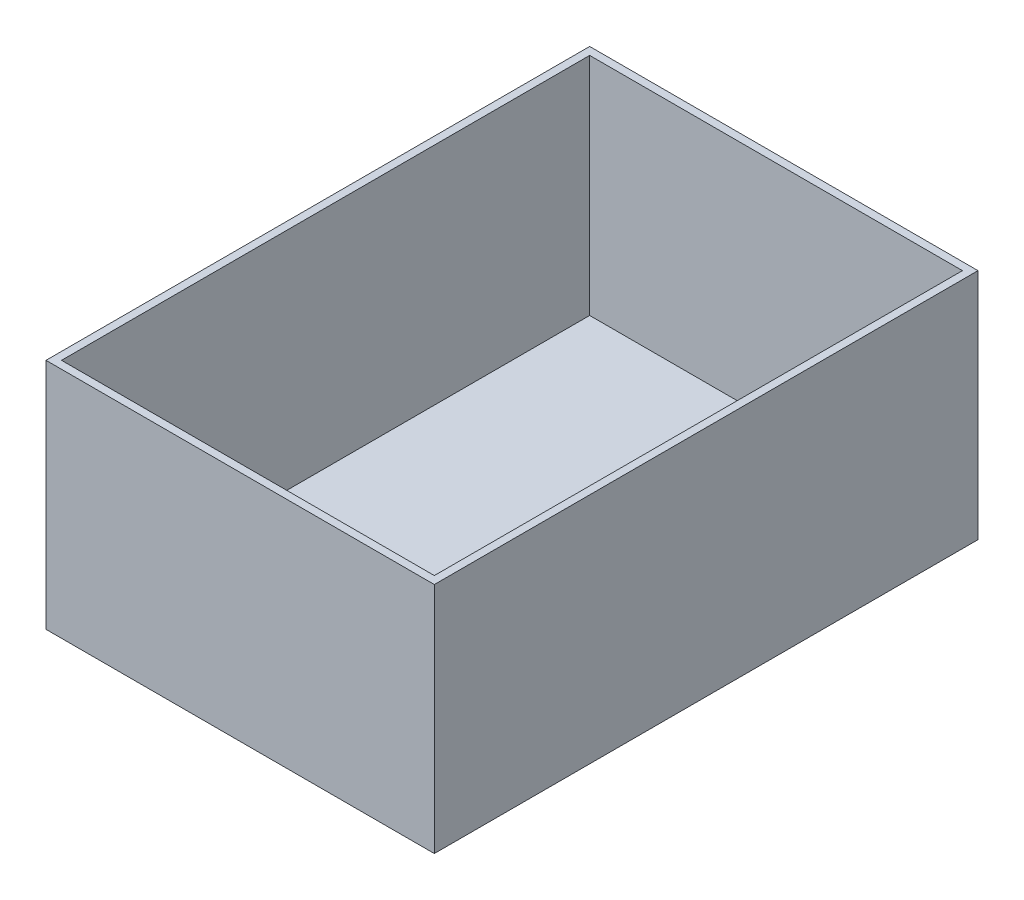
ISO-10303-21;
HEADER;
FILE_DESCRIPTION(('STEP AP214'),'2;1');
FILE_NAME('part.step','',(''),(''),'','','');
FILE_SCHEMA(('AUTOMOTIVE_DESIGN { 1 0 10303 214 1 1 1 1 }'));
ENDSEC;
DATA;
#1=APPLICATION_CONTEXT('core data for automotive mechanical design processes');
#2=APPLICATION_PROTOCOL_DEFINITION('international standard','automotive_design',2000,#1);
#3=PRODUCT_CONTEXT('',#1,'mechanical');
#4=PRODUCT('Part','Part','',(#3));
#5=PRODUCT_RELATED_PRODUCT_CATEGORY('part','',(#4));
#6=PRODUCT_DEFINITION_FORMATION('','',#4);
#7=PRODUCT_DEFINITION_CONTEXT('part definition',#1,'design');
#8=PRODUCT_DEFINITION('design','',#6,#7);
#9=PRODUCT_DEFINITION_SHAPE('','',#8);
#10=(LENGTH_UNIT() NAMED_UNIT(*) SI_UNIT(.MILLI.,.METRE.));
#11=(NAMED_UNIT(*) PLANE_ANGLE_UNIT() SI_UNIT($,.RADIAN.));
#12=(NAMED_UNIT(*) SI_UNIT($,.STERADIAN.) SOLID_ANGLE_UNIT());
#13=UNCERTAINTY_MEASURE_WITH_UNIT(LENGTH_MEASURE(1.E-05),#10,'distance_accuracy_value','');
#14=(GEOMETRIC_REPRESENTATION_CONTEXT(3) GLOBAL_UNCERTAINTY_ASSIGNED_CONTEXT((#13)) GLOBAL_UNIT_ASSIGNED_CONTEXT((#10,
#11,#12)) REPRESENTATION_CONTEXT('',''));
#15=CARTESIAN_POINT('',(0.,0.,0.));
#16=DIRECTION('',(0.,0.,1.));
#17=DIRECTION('',(1.,0.,0.));
#18=AXIS2_PLACEMENT_3D('',#15,#16,#17);
#19=CARTESIAN_POINT('',(0.,150.,0.));
#20=DIRECTION('',(-1.,0.,0.));
#21=DIRECTION('',(0.,0.,1.));
#22=AXIS2_PLACEMENT_3D('',#19,#20,#21);
#23=PLANE('',#22);
#24=DIRECTION('',(0.,0.,-1.));
#25=VECTOR('',#24,1.);
#26=CARTESIAN_POINT('',(0.,0.,0.));
#27=LINE('',#26,#25);
#28=CARTESIAN_POINT('',(0.,0.,0.));
#29=VERTEX_POINT('',#28);
#30=CARTESIAN_POINT('',(0.,0.,-350.));
#31=VERTEX_POINT('',#30);
#32=EDGE_CURVE('E150',#29,#31,#27,.T.);
#33=ORIENTED_EDGE('',*,*,#32,.T.);
#34=DIRECTION('',(0.,-1.,0.));
#35=VECTOR('',#34,1.);
#36=CARTESIAN_POINT('',(0.,150.,-350.));
#37=LINE('',#36,#35);
#38=CARTESIAN_POINT('',(0.,150.,-350.));
#39=VERTEX_POINT('',#38);
#40=EDGE_CURVE('E11',#39,#31,#37,.T.);
#41=ORIENTED_EDGE('',*,*,#40,.F.);
#42=DIRECTION('',(0.,0.,-1.));
#43=VECTOR('',#42,1.);
#44=CARTESIAN_POINT('',(0.,150.,0.));
#45=LINE('',#44,#43);
#46=CARTESIAN_POINT('',(0.,150.,0.));
#47=VERTEX_POINT('',#46);
#48=EDGE_CURVE('E143',#47,#39,#45,.T.);
#49=ORIENTED_EDGE('',*,*,#48,.F.);
#50=DIRECTION('',(0.,-1.,0.));
#51=VECTOR('',#50,1.);
#52=CARTESIAN_POINT('',(0.,150.,0.));
#53=LINE('',#52,#51);
#54=EDGE_CURVE('E149',#47,#29,#53,.T.);
#55=ORIENTED_EDGE('',*,*,#54,.T.);
#56=EDGE_LOOP('',(#33,#41,#49,#55));
#57=FACE_BOUND('',#56,.T.);
#58=ADVANCED_FACE('F36',(#57),#23,.F.);
#59=CARTESIAN_POINT('',(0.,150.,-350.));
#60=DIRECTION('',(0.,0.,1.));
#61=DIRECTION('',(1.,0.,0.));
#62=AXIS2_PLACEMENT_3D('',#59,#60,#61);
#63=PLANE('',#62);
#64=DIRECTION('',(-1.,0.,0.));
#65=VECTOR('',#64,1.);
#66=CARTESIAN_POINT('',(0.,0.,-350.));
#67=LINE('',#66,#65);
#68=CARTESIAN_POINT('',(-250.,0.,-350.));
#69=VERTEX_POINT('',#68);
#70=EDGE_CURVE('E153',#31,#69,#67,.T.);
#71=ORIENTED_EDGE('',*,*,#70,.T.);
#72=DIRECTION('',(0.,-1.,0.));
#73=VECTOR('',#72,1.);
#74=CARTESIAN_POINT('',(-250.,150.,-350.));
#75=LINE('',#74,#73);
#76=CARTESIAN_POINT('',(-250.,150.,-350.));
#77=VERTEX_POINT('',#76);
#78=EDGE_CURVE('E43',#77,#69,#75,.T.);
#79=ORIENTED_EDGE('',*,*,#78,.F.);
#80=DIRECTION('',(-1.,0.,0.));
#81=VECTOR('',#80,1.);
#82=CARTESIAN_POINT('',(0.,150.,-350.));
#83=LINE('',#82,#81);
#84=EDGE_CURVE('E87',#39,#77,#83,.T.);
#85=ORIENTED_EDGE('',*,*,#84,.F.);
#86=ORIENTED_EDGE('',*,*,#40,.T.);
#87=EDGE_LOOP('',(#71,#79,#85,#86));
#88=FACE_BOUND('',#87,.T.);
#89=ADVANCED_FACE('F182',(#88),#63,.F.);
#90=CARTESIAN_POINT('',(-250.,150.,0.));
#91=DIRECTION('',(1.,0.,0.));
#92=DIRECTION('',(0.,0.,-1.));
#93=AXIS2_PLACEMENT_3D('',#90,#91,#92);
#94=PLANE('',#93);
#95=DIRECTION('',(0.,0.,1.));
#96=VECTOR('',#95,1.);
#97=CARTESIAN_POINT('',(-250.,0.,0.));
#98=LINE('',#97,#96);
#99=CARTESIAN_POINT('',(-250.,0.,0.));
#100=VERTEX_POINT('',#99);
#101=EDGE_CURVE('E155',#69,#100,#98,.T.);
#102=ORIENTED_EDGE('',*,*,#101,.T.);
#103=DIRECTION('',(0.,-1.,0.));
#104=VECTOR('',#103,1.);
#105=CARTESIAN_POINT('',(-250.,150.,0.));
#106=LINE('',#105,#104);
#107=CARTESIAN_POINT('',(-250.,150.,0.));
#108=VERTEX_POINT('',#107);
#109=EDGE_CURVE('E159',#108,#100,#106,.T.);
#110=ORIENTED_EDGE('',*,*,#109,.F.);
#111=DIRECTION('',(0.,0.,1.));
#112=VECTOR('',#111,1.);
#113=CARTESIAN_POINT('',(-250.,150.,0.));
#114=LINE('',#113,#112);
#115=EDGE_CURVE('E146',#77,#108,#114,.T.);
#116=ORIENTED_EDGE('',*,*,#115,.F.);
#117=ORIENTED_EDGE('',*,*,#78,.T.);
#118=EDGE_LOOP('',(#102,#110,#116,#117));
#119=FACE_BOUND('',#118,.T.);
#120=ADVANCED_FACE('F164',(#119),#94,.F.);
#121=CARTESIAN_POINT('',(0.,150.,0.));
#122=DIRECTION('',(0.,0.,-1.));
#123=DIRECTION('',(-1.,0.,0.));
#124=AXIS2_PLACEMENT_3D('',#121,#122,#123);
#125=PLANE('',#124);
#126=DIRECTION('',(1.,0.,0.));
#127=VECTOR('',#126,1.);
#128=CARTESIAN_POINT('',(0.,0.,0.));
#129=LINE('',#128,#127);
#130=EDGE_CURVE('E80',#100,#29,#129,.T.);
#131=ORIENTED_EDGE('',*,*,#130,.T.);
#132=ORIENTED_EDGE('',*,*,#54,.F.);
#133=DIRECTION('',(1.,0.,0.));
#134=VECTOR('',#133,1.);
#135=CARTESIAN_POINT('',(0.,150.,0.));
#136=LINE('',#135,#134);
#137=EDGE_CURVE('E59',#108,#47,#136,.T.);
#138=ORIENTED_EDGE('',*,*,#137,.F.);
#139=ORIENTED_EDGE('',*,*,#109,.T.);
#140=EDGE_LOOP('',(#131,#132,#138,#139));
#141=FACE_BOUND('',#140,.T.);
#142=ADVANCED_FACE('F172',(#141),#125,.F.);
#143=CARTESIAN_POINT('',(0.,150.,0.));
#144=DIRECTION('',(0.,1.,0.));
#145=DIRECTION('',(0.,0.,1.));
#146=AXIS2_PLACEMENT_3D('',#143,#144,#145);
#147=PLANE('',#146);
#148=DIRECTION('',(0.,0.,-1.));
#149=VECTOR('',#148,1.);
#150=CARTESIAN_POINT('',(-5.,150.,0.));
#151=LINE('',#150,#149);
#152=CARTESIAN_POINT('',(-5.,150.,-5.));
#153=VERTEX_POINT('',#152);
#154=CARTESIAN_POINT('',(-5.,150.,-345.));
#155=VERTEX_POINT('',#154);
#156=EDGE_CURVE('E132',#153,#155,#151,.T.);
#157=ORIENTED_EDGE('',*,*,#156,.F.);
#158=DIRECTION('',(1.,0.,0.));
#159=VECTOR('',#158,1.);
#160=CARTESIAN_POINT('',(0.,150.,-5.));
#161=LINE('',#160,#159);
#162=CARTESIAN_POINT('',(-245.,150.,-5.));
#163=VERTEX_POINT('',#162);
#164=EDGE_CURVE('E141',#163,#153,#161,.T.);
#165=ORIENTED_EDGE('',*,*,#164,.F.);
#166=DIRECTION('',(0.,0.,1.));
#167=VECTOR('',#166,1.);
#168=CARTESIAN_POINT('',(-245.,150.,0.));
#169=LINE('',#168,#167);
#170=CARTESIAN_POINT('',(-245.,150.,-345.));
#171=VERTEX_POINT('',#170);
#172=EDGE_CURVE('E139',#171,#163,#169,.T.);
#173=ORIENTED_EDGE('',*,*,#172,.F.);
#174=DIRECTION('',(-1.,0.,0.));
#175=VECTOR('',#174,1.);
#176=CARTESIAN_POINT('',(0.,150.,-345.));
#177=LINE('',#176,#175);
#178=EDGE_CURVE('E124',#155,#171,#177,.T.);
#179=ORIENTED_EDGE('',*,*,#178,.F.);
#180=EDGE_LOOP('',(#157,#165,#173,#179));
#181=FACE_BOUND('',#180,.T.);
#182=ORIENTED_EDGE('',*,*,#48,.T.);
#183=ORIENTED_EDGE('',*,*,#84,.T.);
#184=ORIENTED_EDGE('',*,*,#115,.T.);
#185=ORIENTED_EDGE('',*,*,#137,.T.);
#186=EDGE_LOOP('',(#182,#183,#184,#185));
#187=FACE_BOUND('',#186,.T.);
#188=ADVANCED_FACE('F174',(#181,#187),#147,.T.);
#189=CARTESIAN_POINT('',(0.,0.,0.));
#190=DIRECTION('',(0.,1.,0.));
#191=DIRECTION('',(0.,0.,1.));
#192=AXIS2_PLACEMENT_3D('',#189,#190,#191);
#193=PLANE('',#192);
#194=ORIENTED_EDGE('',*,*,#32,.F.);
#195=ORIENTED_EDGE('',*,*,#130,.F.);
#196=ORIENTED_EDGE('',*,*,#101,.F.);
#197=ORIENTED_EDGE('',*,*,#70,.F.);
#198=EDGE_LOOP('',(#194,#195,#196,#197));
#199=FACE_BOUND('',#198,.T.);
#200=ADVANCED_FACE('F168',(#199),#193,.F.);
#201=CARTESIAN_POINT('',(-5.,150.,0.));
#202=DIRECTION('',(-1.,0.,0.));
#203=DIRECTION('',(0.,0.,1.));
#204=AXIS2_PLACEMENT_3D('',#201,#202,#203);
#205=PLANE('',#204);
#206=DIRECTION('',(0.,0.,-1.));
#207=VECTOR('',#206,1.);
#208=CARTESIAN_POINT('',(-5.,5.,0.));
#209=LINE('',#208,#207);
#210=CARTESIAN_POINT('',(-5.,5.,-5.));
#211=VERTEX_POINT('',#210);
#212=CARTESIAN_POINT('',(-5.,5.,-345.));
#213=VERTEX_POINT('',#212);
#214=EDGE_CURVE('E115',#211,#213,#209,.T.);
#215=ORIENTED_EDGE('',*,*,#214,.F.);
#216=DIRECTION('',(0.,-1.,0.));
#217=VECTOR('',#216,1.);
#218=CARTESIAN_POINT('',(-5.,150.,-5.));
#219=LINE('',#218,#217);
#220=EDGE_CURVE('E135',#153,#211,#219,.T.);
#221=ORIENTED_EDGE('',*,*,#220,.F.);
#222=ORIENTED_EDGE('',*,*,#156,.T.);
#223=DIRECTION('',(0.,-1.,0.));
#224=VECTOR('',#223,1.);
#225=CARTESIAN_POINT('',(-5.,150.,-345.));
#226=LINE('',#225,#224);
#227=EDGE_CURVE('E127',#155,#213,#226,.T.);
#228=ORIENTED_EDGE('',*,*,#227,.T.);
#229=EDGE_LOOP('',(#215,#221,#222,#228));
#230=FACE_BOUND('',#229,.T.);
#231=ADVANCED_FACE('F209',(#230),#205,.T.);
#232=CARTESIAN_POINT('',(0.,150.,-345.));
#233=DIRECTION('',(0.,0.,1.));
#234=DIRECTION('',(1.,0.,0.));
#235=AXIS2_PLACEMENT_3D('',#232,#233,#234);
#236=PLANE('',#235);
#237=DIRECTION('',(-1.,0.,0.));
#238=VECTOR('',#237,1.);
#239=CARTESIAN_POINT('',(0.,5.,-345.));
#240=LINE('',#239,#238);
#241=CARTESIAN_POINT('',(-245.,5.,-345.));
#242=VERTEX_POINT('',#241);
#243=EDGE_CURVE('E109',#213,#242,#240,.T.);
#244=ORIENTED_EDGE('',*,*,#243,.F.);
#245=ORIENTED_EDGE('',*,*,#227,.F.);
#246=ORIENTED_EDGE('',*,*,#178,.T.);
#247=DIRECTION('',(0.,-1.,0.));
#248=VECTOR('',#247,1.);
#249=CARTESIAN_POINT('',(-245.,150.,-345.));
#250=LINE('',#249,#248);
#251=EDGE_CURVE('E121',#171,#242,#250,.T.);
#252=ORIENTED_EDGE('',*,*,#251,.T.);
#253=EDGE_LOOP('',(#244,#245,#246,#252));
#254=FACE_BOUND('',#253,.T.);
#255=ADVANCED_FACE('F122',(#254),#236,.T.);
#256=CARTESIAN_POINT('',(-245.,150.,0.));
#257=DIRECTION('',(1.,0.,0.));
#258=DIRECTION('',(0.,0.,-1.));
#259=AXIS2_PLACEMENT_3D('',#256,#257,#258);
#260=PLANE('',#259);
#261=DIRECTION('',(0.,0.,1.));
#262=VECTOR('',#261,1.);
#263=CARTESIAN_POINT('',(-245.,5.,0.));
#264=LINE('',#263,#262);
#265=CARTESIAN_POINT('',(-245.,5.,-5.));
#266=VERTEX_POINT('',#265);
#267=EDGE_CURVE('E113',#242,#266,#264,.T.);
#268=ORIENTED_EDGE('',*,*,#267,.F.);
#269=ORIENTED_EDGE('',*,*,#251,.F.);
#270=ORIENTED_EDGE('',*,*,#172,.T.);
#271=DIRECTION('',(0.,-1.,0.));
#272=VECTOR('',#271,1.);
#273=CARTESIAN_POINT('',(-245.,150.,-5.));
#274=LINE('',#273,#272);
#275=EDGE_CURVE('E50',#163,#266,#274,.T.);
#276=ORIENTED_EDGE('',*,*,#275,.T.);
#277=EDGE_LOOP('',(#268,#269,#270,#276));
#278=FACE_BOUND('',#277,.T.);
#279=ADVANCED_FACE('F129',(#278),#260,.T.);
#280=CARTESIAN_POINT('',(0.,150.,-5.));
#281=DIRECTION('',(0.,0.,-1.));
#282=DIRECTION('',(-1.,0.,0.));
#283=AXIS2_PLACEMENT_3D('',#280,#281,#282);
#284=PLANE('',#283);
#285=DIRECTION('',(1.,0.,0.));
#286=VECTOR('',#285,1.);
#287=CARTESIAN_POINT('',(0.,5.,-5.));
#288=LINE('',#287,#286);
#289=EDGE_CURVE('E130',#266,#211,#288,.T.);
#290=ORIENTED_EDGE('',*,*,#289,.F.);
#291=ORIENTED_EDGE('',*,*,#275,.F.);
#292=ORIENTED_EDGE('',*,*,#164,.T.);
#293=ORIENTED_EDGE('',*,*,#220,.T.);
#294=EDGE_LOOP('',(#290,#291,#292,#293));
#295=FACE_BOUND('',#294,.T.);
#296=ADVANCED_FACE('F239',(#295),#284,.T.);
#297=CARTESIAN_POINT('',(0.,5.,0.));
#298=DIRECTION('',(0.,1.,0.));
#299=DIRECTION('',(0.,0.,1.));
#300=AXIS2_PLACEMENT_3D('',#297,#298,#299);
#301=PLANE('',#300);
#302=ORIENTED_EDGE('',*,*,#214,.T.);
#303=ORIENTED_EDGE('',*,*,#243,.T.);
#304=ORIENTED_EDGE('',*,*,#267,.T.);
#305=ORIENTED_EDGE('',*,*,#289,.T.);
#306=EDGE_LOOP('',(#302,#303,#304,#305));
#307=FACE_BOUND('',#306,.T.);
#308=ADVANCED_FACE('F111',(#307),#301,.T.);
#309=CLOSED_SHELL('',(#58,#89,#120,#142,#188,#200,#231,#255,#279,#296,#308));
#310=MANIFOLD_SOLID_BREP('B2',#309);
#311=ADVANCED_BREP_SHAPE_REPRESENTATION('',(#18,#310),#14);
#312=SHAPE_DEFINITION_REPRESENTATION(#9,#311);
ENDSEC;
END-ISO-10303-21;
